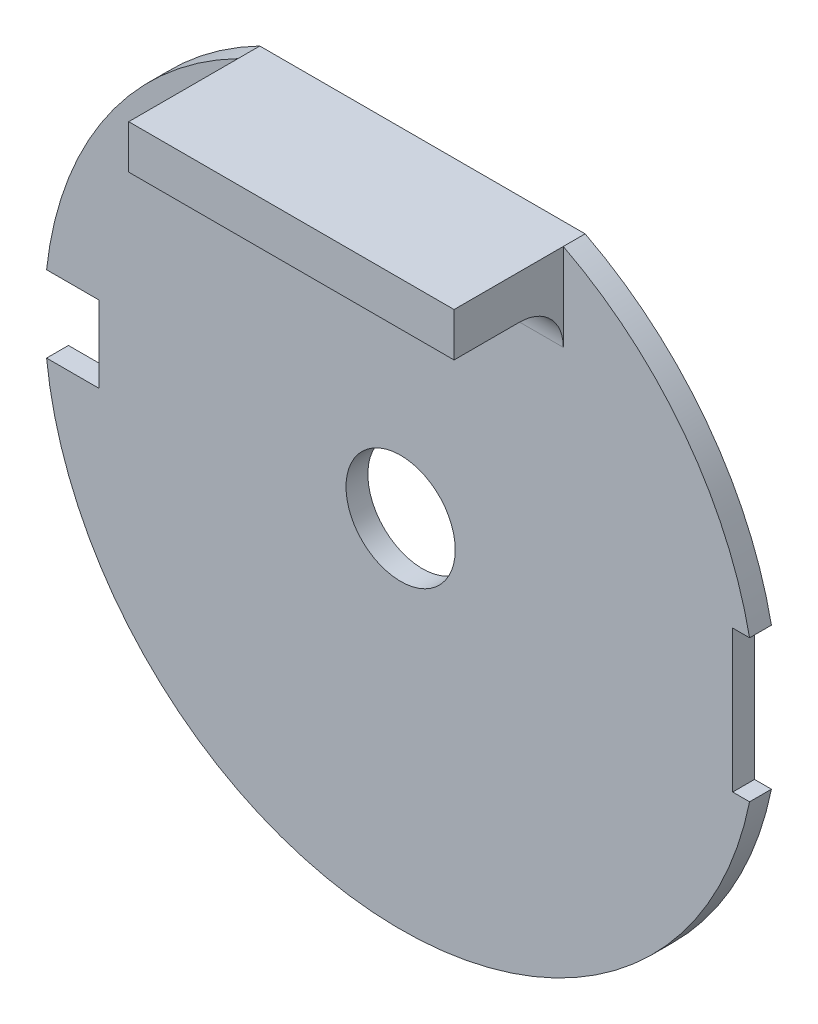
ISO-10303-21;
HEADER;
FILE_DESCRIPTION(('STEP AP214'),'2;1');
FILE_NAME('part.step','',(''),(''),'','','');
FILE_SCHEMA(('AUTOMOTIVE_DESIGN { 1 0 10303 214 1 1 1 1 }'));
ENDSEC;
DATA;
#1=APPLICATION_CONTEXT('core data for automotive mechanical design processes');
#2=APPLICATION_PROTOCOL_DEFINITION('international standard','automotive_design',2000,#1);
#3=PRODUCT_CONTEXT('',#1,'mechanical');
#4=PRODUCT('Part','Part','',(#3));
#5=PRODUCT_RELATED_PRODUCT_CATEGORY('part','',(#4));
#6=PRODUCT_DEFINITION_FORMATION('','',#4);
#7=PRODUCT_DEFINITION_CONTEXT('part definition',#1,'design');
#8=PRODUCT_DEFINITION('design','',#6,#7);
#9=PRODUCT_DEFINITION_SHAPE('','',#8);
#10=(LENGTH_UNIT() NAMED_UNIT(*) SI_UNIT(.MILLI.,.METRE.));
#11=(NAMED_UNIT(*) PLANE_ANGLE_UNIT() SI_UNIT($,.RADIAN.));
#12=(NAMED_UNIT(*) SI_UNIT($,.STERADIAN.) SOLID_ANGLE_UNIT());
#13=UNCERTAINTY_MEASURE_WITH_UNIT(LENGTH_MEASURE(1.E-05),#10,'distance_accuracy_value','');
#14=(GEOMETRIC_REPRESENTATION_CONTEXT(3) GLOBAL_UNCERTAINTY_ASSIGNED_CONTEXT((#13)) GLOBAL_UNIT_ASSIGNED_CONTEXT((#10,
#11,#12)) REPRESENTATION_CONTEXT('',''));
#15=CARTESIAN_POINT('',(0.,0.,0.));
#16=DIRECTION('',(0.,0.,1.));
#17=DIRECTION('',(1.,0.,0.));
#18=AXIS2_PLACEMENT_3D('',#15,#16,#17);
#19=CARTESIAN_POINT('',(0.,0.,1.));
#20=DIRECTION('',(0.,0.,-1.));
#21=DIRECTION('',(-1.,0.,0.));
#22=AXIS2_PLACEMENT_3D('',#19,#20,#21);
#23=CYLINDRICAL_SURFACE('',#22,16.3);
#24=CARTESIAN_POINT('',(0.,0.,0.));
#25=DIRECTION('',(0.,0.,1.));
#26=DIRECTION('',(1.,0.,0.));
#27=AXIS2_PLACEMENT_3D('',#24,#25,#26);
#28=CIRCLE('',#27,16.3);
#29=CARTESIAN_POINT('',(-7.44580418759452,14.5,0.));
#30=VERTEX_POINT('',#29);
#31=CARTESIAN_POINT('',(-16.2057860037704,1.75,0.));
#32=VERTEX_POINT('',#31);
#33=EDGE_CURVE('E247',#30,#32,#28,.T.);
#34=ORIENTED_EDGE('',*,*,#33,.T.);
#35=DIRECTION('',(0.,0.,-1.));
#36=VECTOR('',#35,1.);
#37=CARTESIAN_POINT('',(-16.2057860037704,1.75,1.));
#38=LINE('',#37,#36);
#39=CARTESIAN_POINT('',(-16.2057860037704,1.75,1.));
#40=VERTEX_POINT('',#39);
#41=EDGE_CURVE('E274',#32,#40,#38,.F.);
#42=ORIENTED_EDGE('',*,*,#41,.T.);
#43=CARTESIAN_POINT('',(0.,0.,1.));
#44=DIRECTION('',(0.,0.,1.));
#45=DIRECTION('',(1.,0.,0.));
#46=AXIS2_PLACEMENT_3D('',#43,#44,#45);
#47=CIRCLE('',#46,16.3);
#48=CARTESIAN_POINT('',(-7.44580418759452,14.5,1.));
#49=VERTEX_POINT('',#48);
#50=EDGE_CURVE('E240',#49,#40,#47,.T.);
#51=ORIENTED_EDGE('',*,*,#50,.F.);
#52=DIRECTION('',(0.,0.,-1.));
#53=VECTOR('',#52,1.);
#54=CARTESIAN_POINT('',(-7.44580418759452,14.5,1.));
#55=LINE('',#54,#53);
#56=EDGE_CURVE('E244',#49,#30,#55,.T.);
#57=ORIENTED_EDGE('',*,*,#56,.T.);
#58=EDGE_LOOP('',(#34,#42,#51,#57));
#59=FACE_BOUND('',#58,.T.);
#60=ADVANCED_FACE('F41',(#59),#23,.T.);
#61=CARTESIAN_POINT('',(15.9727111036292,3.25,1.));
#62=VERTEX_POINT('',#61);
#63=CARTESIAN_POINT('',(7.44580418759452,14.5,1.));
#64=VERTEX_POINT('',#63);
#65=EDGE_CURVE('E246',#62,#64,#47,.T.);
#66=ORIENTED_EDGE('',*,*,#65,.F.);
#67=DIRECTION('',(0.,0.,-1.));
#68=VECTOR('',#67,1.);
#69=CARTESIAN_POINT('',(15.9727111036292,3.25,1.));
#70=LINE('',#69,#68);
#71=CARTESIAN_POINT('',(15.9727111036292,3.25,0.));
#72=VERTEX_POINT('',#71);
#73=EDGE_CURVE('E266',#62,#72,#70,.T.);
#74=ORIENTED_EDGE('',*,*,#73,.T.);
#75=CARTESIAN_POINT('',(7.44580418759452,14.5,0.));
#76=VERTEX_POINT('',#75);
#77=EDGE_CURVE('E236',#72,#76,#28,.T.);
#78=ORIENTED_EDGE('',*,*,#77,.T.);
#79=DIRECTION('',(0.,0.,-1.));
#80=VECTOR('',#79,1.);
#81=CARTESIAN_POINT('',(7.44580418759452,14.5,1.));
#82=LINE('',#81,#80);
#83=EDGE_CURVE('E258',#64,#76,#82,.T.);
#84=ORIENTED_EDGE('',*,*,#83,.F.);
#85=EDGE_LOOP('',(#66,#74,#78,#84));
#86=FACE_BOUND('',#85,.T.);
#87=ADVANCED_FACE('F315',(#86),#23,.T.);
#88=CARTESIAN_POINT('',(0.,0.,1.));
#89=DIRECTION('',(0.,0.,1.));
#90=DIRECTION('',(1.,0.,0.));
#91=AXIS2_PLACEMENT_3D('',#88,#89,#90);
#92=PLANE('',#91);
#93=DIRECTION('',(0.,1.,0.));
#94=VECTOR('',#93,1.);
#95=CARTESIAN_POINT('',(7.44580418759452,14.5,1.));
#96=LINE('',#95,#94);
#97=CARTESIAN_POINT('',(7.44580418759452,10.5,1.));
#98=VERTEX_POINT('',#97);
#99=EDGE_CURVE('E57',#98,#64,#96,.T.);
#100=ORIENTED_EDGE('',*,*,#99,.F.);
#101=DIRECTION('',(1.,0.,0.));
#102=VECTOR('',#101,1.);
#103=CARTESIAN_POINT('',(0.,10.5,1.));
#104=LINE('',#103,#102);
#105=CARTESIAN_POINT('',(-7.44580418759452,10.5,1.));
#106=VERTEX_POINT('',#105);
#107=EDGE_CURVE('E281',#98,#106,#104,.F.);
#108=ORIENTED_EDGE('',*,*,#107,.T.);
#109=DIRECTION('',(0.,-1.,0.));
#110=VECTOR('',#109,1.);
#111=CARTESIAN_POINT('',(-7.44580418759452,14.5,1.));
#112=LINE('',#111,#110);
#113=EDGE_CURVE('E64',#49,#106,#112,.T.);
#114=ORIENTED_EDGE('',*,*,#113,.F.);
#115=ORIENTED_EDGE('',*,*,#50,.T.);
#116=DIRECTION('',(-1.,0.,0.));
#117=VECTOR('',#116,1.);
#118=CARTESIAN_POINT('',(-18.8,1.75,1.));
#119=LINE('',#118,#117);
#120=CARTESIAN_POINT('',(-13.8,1.75,1.));
#121=VERTEX_POINT('',#120);
#122=EDGE_CURVE('E183',#121,#40,#119,.T.);
#123=ORIENTED_EDGE('',*,*,#122,.F.);
#124=DIRECTION('',(0.,1.,0.));
#125=VECTOR('',#124,1.);
#126=CARTESIAN_POINT('',(-13.8,1.75,1.));
#127=LINE('',#126,#125);
#128=CARTESIAN_POINT('',(-13.8,-1.75,1.));
#129=VERTEX_POINT('',#128);
#130=EDGE_CURVE('E195',#129,#121,#127,.T.);
#131=ORIENTED_EDGE('',*,*,#130,.F.);
#132=DIRECTION('',(1.,0.,0.));
#133=VECTOR('',#132,1.);
#134=CARTESIAN_POINT('',(-18.8,-1.75,1.));
#135=LINE('',#134,#133);
#136=CARTESIAN_POINT('',(-16.2057860037704,-1.75,1.));
#137=VERTEX_POINT('',#136);
#138=EDGE_CURVE('E192',#137,#129,#135,.T.);
#139=ORIENTED_EDGE('',*,*,#138,.F.);
#140=CARTESIAN_POINT('',(15.9727111036292,-3.25,1.));
#141=VERTEX_POINT('',#140);
#142=EDGE_CURVE('E245',#137,#141,#47,.T.);
#143=ORIENTED_EDGE('',*,*,#142,.T.);
#144=DIRECTION('',(1.,0.,0.));
#145=VECTOR('',#144,1.);
#146=CARTESIAN_POINT('',(15.2,-3.25,1.));
#147=LINE('',#146,#145);
#148=CARTESIAN_POINT('',(15.2,-3.25,1.));
#149=VERTEX_POINT('',#148);
#150=EDGE_CURVE('E172',#149,#141,#147,.T.);
#151=ORIENTED_EDGE('',*,*,#150,.F.);
#152=DIRECTION('',(0.,-1.,0.));
#153=VECTOR('',#152,1.);
#154=CARTESIAN_POINT('',(15.2,3.25,1.));
#155=LINE('',#154,#153);
#156=CARTESIAN_POINT('',(15.2,3.25,1.));
#157=VERTEX_POINT('',#156);
#158=EDGE_CURVE('E167',#157,#149,#155,.T.);
#159=ORIENTED_EDGE('',*,*,#158,.F.);
#160=DIRECTION('',(-1.,0.,0.));
#161=VECTOR('',#160,1.);
#162=CARTESIAN_POINT('',(15.2,3.25,1.));
#163=LINE('',#162,#161);
#164=EDGE_CURVE('E214',#62,#157,#163,.T.);
#165=ORIENTED_EDGE('',*,*,#164,.F.);
#166=ORIENTED_EDGE('',*,*,#65,.T.);
#167=EDGE_LOOP('',(#100,#108,#114,#115,#123,#131,#139,#143,#151,#159,#165,#166));
#168=FACE_BOUND('',#167,.T.);
#169=CARTESIAN_POINT('',(0.,0.,1.));
#170=DIRECTION('',(0.,0.,1.));
#171=DIRECTION('',(1.,0.,0.));
#172=AXIS2_PLACEMENT_3D('',#169,#170,#171);
#173=CIRCLE('',#172,2.5);
#174=CARTESIAN_POINT('',(2.5,0.,1.));
#175=VERTEX_POINT('',#174);
#176=EDGE_CURVE('E232',#175,#175,#173,.T.);
#177=ORIENTED_EDGE('',*,*,#176,.F.);
#178=EDGE_LOOP('',(#177));
#179=FACE_BOUND('',#178,.T.);
#180=ADVANCED_FACE('F290',(#168,#179),#92,.T.);
#181=CARTESIAN_POINT('',(0.,0.,0.));
#182=DIRECTION('',(0.,0.,1.));
#183=DIRECTION('',(1.,0.,0.));
#184=AXIS2_PLACEMENT_3D('',#181,#182,#183);
#185=PLANE('',#184);
#186=DIRECTION('',(0.,1.,0.));
#187=VECTOR('',#186,1.);
#188=CARTESIAN_POINT('',(-13.8,1.75,0.));
#189=LINE('',#188,#187);
#190=CARTESIAN_POINT('',(-13.8,-1.75,0.));
#191=VERTEX_POINT('',#190);
#192=CARTESIAN_POINT('',(-13.8,1.75,0.));
#193=VERTEX_POINT('',#192);
#194=EDGE_CURVE('E182',#191,#193,#189,.T.);
#195=ORIENTED_EDGE('',*,*,#194,.T.);
#196=DIRECTION('',(-1.,0.,0.));
#197=VECTOR('',#196,1.);
#198=CARTESIAN_POINT('',(-18.8,1.75,0.));
#199=LINE('',#198,#197);
#200=EDGE_CURVE('E187',#193,#32,#199,.T.);
#201=ORIENTED_EDGE('',*,*,#200,.T.);
#202=ORIENTED_EDGE('',*,*,#33,.F.);
#203=DIRECTION('',(-1.,0.,0.));
#204=VECTOR('',#203,1.);
#205=CARTESIAN_POINT('',(-7.44580418759452,14.5,0.));
#206=LINE('',#205,#204);
#207=EDGE_CURVE('E251',#76,#30,#206,.T.);
#208=ORIENTED_EDGE('',*,*,#207,.F.);
#209=ORIENTED_EDGE('',*,*,#77,.F.);
#210=DIRECTION('',(-1.,0.,0.));
#211=VECTOR('',#210,1.);
#212=CARTESIAN_POINT('',(15.2,3.25,0.));
#213=LINE('',#212,#211);
#214=CARTESIAN_POINT('',(15.2,3.25,0.));
#215=VERTEX_POINT('',#214);
#216=EDGE_CURVE('E218',#72,#215,#213,.T.);
#217=ORIENTED_EDGE('',*,*,#216,.T.);
#218=DIRECTION('',(0.,-1.,0.));
#219=VECTOR('',#218,1.);
#220=CARTESIAN_POINT('',(15.2,3.25,0.));
#221=LINE('',#220,#219);
#222=CARTESIAN_POINT('',(15.2,-3.25,0.));
#223=VERTEX_POINT('',#222);
#224=EDGE_CURVE('E209',#215,#223,#221,.T.);
#225=ORIENTED_EDGE('',*,*,#224,.T.);
#226=DIRECTION('',(1.,0.,0.));
#227=VECTOR('',#226,1.);
#228=CARTESIAN_POINT('',(15.2,-3.25,0.));
#229=LINE('',#228,#227);
#230=CARTESIAN_POINT('',(15.9727111036292,-3.25,0.));
#231=VERTEX_POINT('',#230);
#232=EDGE_CURVE('E213',#223,#231,#229,.T.);
#233=ORIENTED_EDGE('',*,*,#232,.T.);
#234=CARTESIAN_POINT('',(-16.2057860037704,-1.75,0.));
#235=VERTEX_POINT('',#234);
#236=EDGE_CURVE('E252',#235,#231,#28,.T.);
#237=ORIENTED_EDGE('',*,*,#236,.F.);
#238=DIRECTION('',(1.,0.,0.));
#239=VECTOR('',#238,1.);
#240=CARTESIAN_POINT('',(-18.8,-1.75,0.));
#241=LINE('',#240,#239);
#242=EDGE_CURVE('E178',#235,#191,#241,.T.);
#243=ORIENTED_EDGE('',*,*,#242,.T.);
#244=EDGE_LOOP('',(#195,#201,#202,#208,#209,#217,#225,#233,#237,#243));
#245=FACE_BOUND('',#244,.T.);
#246=CARTESIAN_POINT('',(0.,0.,0.));
#247=DIRECTION('',(0.,0.,1.));
#248=DIRECTION('',(1.,0.,0.));
#249=AXIS2_PLACEMENT_3D('',#246,#247,#248);
#250=CIRCLE('',#249,2.5);
#251=CARTESIAN_POINT('',(2.5,0.,0.));
#252=VERTEX_POINT('',#251);
#253=EDGE_CURVE('E205',#252,#252,#250,.T.);
#254=ORIENTED_EDGE('',*,*,#253,.T.);
#255=EDGE_LOOP('',(#254));
#256=FACE_BOUND('',#255,.T.);
#257=ADVANCED_FACE('F319',(#245,#256),#185,.F.);
#258=ORIENTED_EDGE('',*,*,#142,.F.);
#259=DIRECTION('',(0.,0.,-1.));
#260=VECTOR('',#259,1.);
#261=CARTESIAN_POINT('',(-16.2057860037704,-1.75,1.));
#262=LINE('',#261,#260);
#263=EDGE_CURVE('E270',#137,#235,#262,.T.);
#264=ORIENTED_EDGE('',*,*,#263,.T.);
#265=ORIENTED_EDGE('',*,*,#236,.T.);
#266=DIRECTION('',(0.,0.,-1.));
#267=VECTOR('',#266,1.);
#268=CARTESIAN_POINT('',(15.9727111036292,-3.25,1.));
#269=LINE('',#268,#267);
#270=EDGE_CURVE('E262',#231,#141,#269,.F.);
#271=ORIENTED_EDGE('',*,*,#270,.T.);
#272=EDGE_LOOP('',(#258,#264,#265,#271));
#273=FACE_BOUND('',#272,.T.);
#274=ADVANCED_FACE('F336',(#273),#23,.T.);
#275=CARTESIAN_POINT('',(-7.44580418759452,14.5,1.));
#276=DIRECTION('',(0.,-1.,0.));
#277=DIRECTION('',(0.,0.,-1.));
#278=AXIS2_PLACEMENT_3D('',#275,#276,#277);
#279=PLANE('',#278);
#280=ORIENTED_EDGE('',*,*,#207,.T.);
#281=ORIENTED_EDGE('',*,*,#56,.F.);
#282=DIRECTION('',(0.,0.,-1.));
#283=VECTOR('',#282,1.);
#284=CARTESIAN_POINT('',(-7.44580418759452,14.5,6.));
#285=LINE('',#284,#283);
#286=CARTESIAN_POINT('',(-7.44580418759452,14.5,6.));
#287=VERTEX_POINT('',#286);
#288=EDGE_CURVE('E299',#287,#49,#285,.T.);
#289=ORIENTED_EDGE('',*,*,#288,.F.);
#290=DIRECTION('',(-1.,0.,0.));
#291=VECTOR('',#290,1.);
#292=CARTESIAN_POINT('',(-7.44580418759452,14.5,6.));
#293=LINE('',#292,#291);
#294=CARTESIAN_POINT('',(7.44580418759452,14.5,6.));
#295=VERTEX_POINT('',#294);
#296=EDGE_CURVE('E160',#295,#287,#293,.T.);
#297=ORIENTED_EDGE('',*,*,#296,.F.);
#298=DIRECTION('',(0.,0.,-1.));
#299=VECTOR('',#298,1.);
#300=CARTESIAN_POINT('',(7.44580418759452,14.5,6.));
#301=LINE('',#300,#299);
#302=EDGE_CURVE('E174',#295,#64,#301,.T.);
#303=ORIENTED_EDGE('',*,*,#302,.T.);
#304=ORIENTED_EDGE('',*,*,#83,.T.);
#305=EDGE_LOOP('',(#280,#281,#289,#297,#303,#304));
#306=FACE_BOUND('',#305,.T.);
#307=ADVANCED_FACE('F298',(#306),#279,.F.);
#308=CARTESIAN_POINT('',(0.,0.,1.));
#309=DIRECTION('',(0.,0.,-1.));
#310=DIRECTION('',(-1.,0.,0.));
#311=AXIS2_PLACEMENT_3D('',#308,#309,#310);
#312=CYLINDRICAL_SURFACE('',#311,2.5);
#313=ORIENTED_EDGE('',*,*,#176,.T.);
#314=EDGE_LOOP('',(#313));
#315=FACE_BOUND('',#314,.T.);
#316=ORIENTED_EDGE('',*,*,#253,.F.);
#317=EDGE_LOOP('',(#316));
#318=FACE_BOUND('',#317,.T.);
#319=ADVANCED_FACE('F352',(#315,#318),#312,.F.);
#320=CARTESIAN_POINT('',(15.2,3.25,0.));
#321=DIRECTION('',(0.,1.,0.));
#322=DIRECTION('',(0.,0.,1.));
#323=AXIS2_PLACEMENT_3D('',#320,#321,#322);
#324=PLANE('',#323);
#325=ORIENTED_EDGE('',*,*,#164,.T.);
#326=DIRECTION('',(0.,0.,1.));
#327=VECTOR('',#326,1.);
#328=CARTESIAN_POINT('',(15.2,3.25,0.));
#329=LINE('',#328,#327);
#330=EDGE_CURVE('E196',#215,#157,#329,.T.);
#331=ORIENTED_EDGE('',*,*,#330,.F.);
#332=ORIENTED_EDGE('',*,*,#216,.F.);
#333=ORIENTED_EDGE('',*,*,#73,.F.);
#334=EDGE_LOOP('',(#325,#331,#332,#333));
#335=FACE_BOUND('',#334,.T.);
#336=ADVANCED_FACE('F350',(#335),#324,.F.);
#337=CARTESIAN_POINT('',(15.2,-3.25,0.));
#338=DIRECTION('',(0.,-1.,0.));
#339=DIRECTION('',(0.,0.,-1.));
#340=AXIS2_PLACEMENT_3D('',#337,#338,#339);
#341=PLANE('',#340);
#342=ORIENTED_EDGE('',*,*,#232,.F.);
#343=DIRECTION('',(0.,0.,1.));
#344=VECTOR('',#343,1.);
#345=CARTESIAN_POINT('',(15.2,-3.25,0.));
#346=LINE('',#345,#344);
#347=EDGE_CURVE('E221',#223,#149,#346,.T.);
#348=ORIENTED_EDGE('',*,*,#347,.T.);
#349=ORIENTED_EDGE('',*,*,#150,.T.);
#350=ORIENTED_EDGE('',*,*,#270,.F.);
#351=EDGE_LOOP('',(#342,#348,#349,#350));
#352=FACE_BOUND('',#351,.T.);
#353=ADVANCED_FACE('F345',(#352),#341,.F.);
#354=CARTESIAN_POINT('',(15.2,3.25,0.));
#355=DIRECTION('',(-1.,0.,0.));
#356=DIRECTION('',(0.,0.,1.));
#357=AXIS2_PLACEMENT_3D('',#354,#355,#356);
#358=PLANE('',#357);
#359=ORIENTED_EDGE('',*,*,#158,.T.);
#360=ORIENTED_EDGE('',*,*,#347,.F.);
#361=ORIENTED_EDGE('',*,*,#224,.F.);
#362=ORIENTED_EDGE('',*,*,#330,.T.);
#363=EDGE_LOOP('',(#359,#360,#361,#362));
#364=FACE_BOUND('',#363,.T.);
#365=ADVANCED_FACE('F348',(#364),#358,.F.);
#366=CARTESIAN_POINT('',(-18.8,1.75,0.));
#367=DIRECTION('',(0.,1.,0.));
#368=DIRECTION('',(0.,0.,1.));
#369=AXIS2_PLACEMENT_3D('',#366,#367,#368);
#370=PLANE('',#369);
#371=ORIENTED_EDGE('',*,*,#200,.F.);
#372=DIRECTION('',(0.,0.,1.));
#373=VECTOR('',#372,1.);
#374=CARTESIAN_POINT('',(-13.8,1.75,0.));
#375=LINE('',#374,#373);
#376=EDGE_CURVE('E202',#193,#121,#375,.T.);
#377=ORIENTED_EDGE('',*,*,#376,.T.);
#378=ORIENTED_EDGE('',*,*,#122,.T.);
#379=ORIENTED_EDGE('',*,*,#41,.F.);
#380=EDGE_LOOP('',(#371,#377,#378,#379));
#381=FACE_BOUND('',#380,.T.);
#382=ADVANCED_FACE('F324',(#381),#370,.F.);
#383=CARTESIAN_POINT('',(-18.8,-1.75,0.));
#384=DIRECTION('',(0.,-1.,0.));
#385=DIRECTION('',(0.,0.,-1.));
#386=AXIS2_PLACEMENT_3D('',#383,#384,#385);
#387=PLANE('',#386);
#388=ORIENTED_EDGE('',*,*,#138,.T.);
#389=DIRECTION('',(0.,0.,1.));
#390=VECTOR('',#389,1.);
#391=CARTESIAN_POINT('',(-13.8,-1.75,0.));
#392=LINE('',#391,#390);
#393=EDGE_CURVE('E191',#191,#129,#392,.T.);
#394=ORIENTED_EDGE('',*,*,#393,.F.);
#395=ORIENTED_EDGE('',*,*,#242,.F.);
#396=ORIENTED_EDGE('',*,*,#263,.F.);
#397=EDGE_LOOP('',(#388,#394,#395,#396));
#398=FACE_BOUND('',#397,.T.);
#399=ADVANCED_FACE('F332',(#398),#387,.F.);
#400=CARTESIAN_POINT('',(-13.8,1.75,0.));
#401=DIRECTION('',(1.,0.,0.));
#402=DIRECTION('',(0.,0.,-1.));
#403=AXIS2_PLACEMENT_3D('',#400,#401,#402);
#404=PLANE('',#403);
#405=ORIENTED_EDGE('',*,*,#130,.T.);
#406=ORIENTED_EDGE('',*,*,#376,.F.);
#407=ORIENTED_EDGE('',*,*,#194,.F.);
#408=ORIENTED_EDGE('',*,*,#393,.T.);
#409=EDGE_LOOP('',(#405,#406,#407,#408));
#410=FACE_BOUND('',#409,.T.);
#411=ADVANCED_FACE('F330',(#410),#404,.F.);
#412=CARTESIAN_POINT('',(-7.44580418759452,14.5,6.));
#413=DIRECTION('',(1.,0.,0.));
#414=DIRECTION('',(0.,0.,-1.));
#415=AXIS2_PLACEMENT_3D('',#412,#413,#414);
#416=PLANE('',#415);
#417=ORIENTED_EDGE('',*,*,#113,.T.);
#418=CARTESIAN_POINT('',(-7.44580418759452,10.5,3.));
#419=DIRECTION('',(1.,0.,0.));
#420=DIRECTION('',(0.,0.,-1.));
#421=AXIS2_PLACEMENT_3D('',#418,#419,#420);
#422=CIRCLE('',#421,2.);
#423=CARTESIAN_POINT('',(-7.44580418759452,12.5,3.));
#424=VERTEX_POINT('',#423);
#425=EDGE_CURVE('E11',#106,#424,#422,.T.);
#426=ORIENTED_EDGE('',*,*,#425,.T.);
#427=DIRECTION('',(0.,0.,-1.));
#428=VECTOR('',#427,1.);
#429=CARTESIAN_POINT('',(-7.44580418759452,12.5,6.));
#430=LINE('',#429,#428);
#431=CARTESIAN_POINT('',(-7.44580418759452,12.5,6.));
#432=VERTEX_POINT('',#431);
#433=EDGE_CURVE('E147',#432,#424,#430,.T.);
#434=ORIENTED_EDGE('',*,*,#433,.F.);
#435=DIRECTION('',(0.,-1.,0.));
#436=VECTOR('',#435,1.);
#437=CARTESIAN_POINT('',(-7.44580418759452,14.5,6.));
#438=LINE('',#437,#436);
#439=EDGE_CURVE('E155',#287,#432,#438,.T.);
#440=ORIENTED_EDGE('',*,*,#439,.F.);
#441=ORIENTED_EDGE('',*,*,#288,.T.);
#442=EDGE_LOOP('',(#417,#426,#434,#440,#441));
#443=FACE_BOUND('',#442,.T.);
#444=ADVANCED_FACE('F164',(#443),#416,.F.);
#445=CARTESIAN_POINT('',(-7.44580418759452,12.5,6.));
#446=DIRECTION('',(0.,1.,0.));
#447=DIRECTION('',(0.,0.,1.));
#448=AXIS2_PLACEMENT_3D('',#445,#446,#447);
#449=PLANE('',#448);
#450=ORIENTED_EDGE('',*,*,#433,.T.);
#451=DIRECTION('',(1.,0.,0.));
#452=VECTOR('',#451,1.);
#453=CARTESIAN_POINT('',(-7.44580418759452,12.5,3.));
#454=LINE('',#453,#452);
#455=CARTESIAN_POINT('',(7.44580418759452,12.5,3.));
#456=VERTEX_POINT('',#455);
#457=EDGE_CURVE('E278',#424,#456,#454,.T.);
#458=ORIENTED_EDGE('',*,*,#457,.T.);
#459=DIRECTION('',(0.,0.,-1.));
#460=VECTOR('',#459,1.);
#461=CARTESIAN_POINT('',(7.44580418759452,12.5,6.));
#462=LINE('',#461,#460);
#463=CARTESIAN_POINT('',(7.44580418759452,12.5,6.));
#464=VERTEX_POINT('',#463);
#465=EDGE_CURVE('E150',#464,#456,#462,.T.);
#466=ORIENTED_EDGE('',*,*,#465,.F.);
#467=DIRECTION('',(1.,0.,0.));
#468=VECTOR('',#467,1.);
#469=CARTESIAN_POINT('',(-7.44580418759452,12.5,6.));
#470=LINE('',#469,#468);
#471=EDGE_CURVE('E142',#432,#464,#470,.T.);
#472=ORIENTED_EDGE('',*,*,#471,.F.);
#473=EDGE_LOOP('',(#450,#458,#466,#472));
#474=FACE_BOUND('',#473,.T.);
#475=ADVANCED_FACE('F144',(#474),#449,.F.);
#476=CARTESIAN_POINT('',(7.44580418759452,14.5,6.));
#477=DIRECTION('',(-1.,0.,0.));
#478=DIRECTION('',(0.,0.,1.));
#479=AXIS2_PLACEMENT_3D('',#476,#477,#478);
#480=PLANE('',#479);
#481=ORIENTED_EDGE('',*,*,#99,.T.);
#482=ORIENTED_EDGE('',*,*,#302,.F.);
#483=DIRECTION('',(0.,1.,0.));
#484=VECTOR('',#483,1.);
#485=CARTESIAN_POINT('',(7.44580418759452,14.5,6.));
#486=LINE('',#485,#484);
#487=EDGE_CURVE('E154',#464,#295,#486,.T.);
#488=ORIENTED_EDGE('',*,*,#487,.F.);
#489=ORIENTED_EDGE('',*,*,#465,.T.);
#490=CARTESIAN_POINT('',(7.44580418759452,10.5,3.));
#491=DIRECTION('',(-1.,0.,0.));
#492=DIRECTION('',(0.,0.,1.));
#493=AXIS2_PLACEMENT_3D('',#490,#491,#492);
#494=CIRCLE('',#493,2.);
#495=EDGE_CURVE('E50',#456,#98,#494,.T.);
#496=ORIENTED_EDGE('',*,*,#495,.T.);
#497=EDGE_LOOP('',(#481,#482,#488,#489,#496));
#498=FACE_BOUND('',#497,.T.);
#499=ADVANCED_FACE('F286',(#498),#480,.F.);
#500=CARTESIAN_POINT('',(0.,0.,6.));
#501=DIRECTION('',(0.,0.,1.));
#502=DIRECTION('',(1.,0.,0.));
#503=AXIS2_PLACEMENT_3D('',#500,#501,#502);
#504=PLANE('',#503);
#505=ORIENTED_EDGE('',*,*,#439,.T.);
#506=ORIENTED_EDGE('',*,*,#471,.T.);
#507=ORIENTED_EDGE('',*,*,#487,.T.);
#508=ORIENTED_EDGE('',*,*,#296,.T.);
#509=EDGE_LOOP('',(#505,#506,#507,#508));
#510=FACE_BOUND('',#509,.T.);
#511=ADVANCED_FACE('F158',(#510),#504,.T.);
#512=CARTESIAN_POINT('',(-7.44580418759452,10.5,3.));
#513=DIRECTION('',(1.,0.,0.));
#514=DIRECTION('',(0.,0.,-1.));
#515=AXIS2_PLACEMENT_3D('',#512,#513,#514);
#516=CYLINDRICAL_SURFACE('',#515,2.);
#517=ORIENTED_EDGE('',*,*,#425,.F.);
#518=ORIENTED_EDGE('',*,*,#107,.F.);
#519=ORIENTED_EDGE('',*,*,#495,.F.);
#520=ORIENTED_EDGE('',*,*,#457,.F.);
#521=EDGE_LOOP('',(#517,#518,#519,#520));
#522=FACE_BOUND('',#521,.T.);
#523=ADVANCED_FACE('F43',(#522),#516,.F.);
#524=CLOSED_SHELL('',(#60,#87,#180,#257,#274,#307,#319,#336,#353,#365,#382,#399,#411,#444,#475,
#499,#511,#523));
#525=MANIFOLD_SOLID_BREP('B2',#524);
#526=ADVANCED_BREP_SHAPE_REPRESENTATION('',(#18,#525),#14);
#527=SHAPE_DEFINITION_REPRESENTATION(#9,#526);
ENDSEC;
END-ISO-10303-21;
